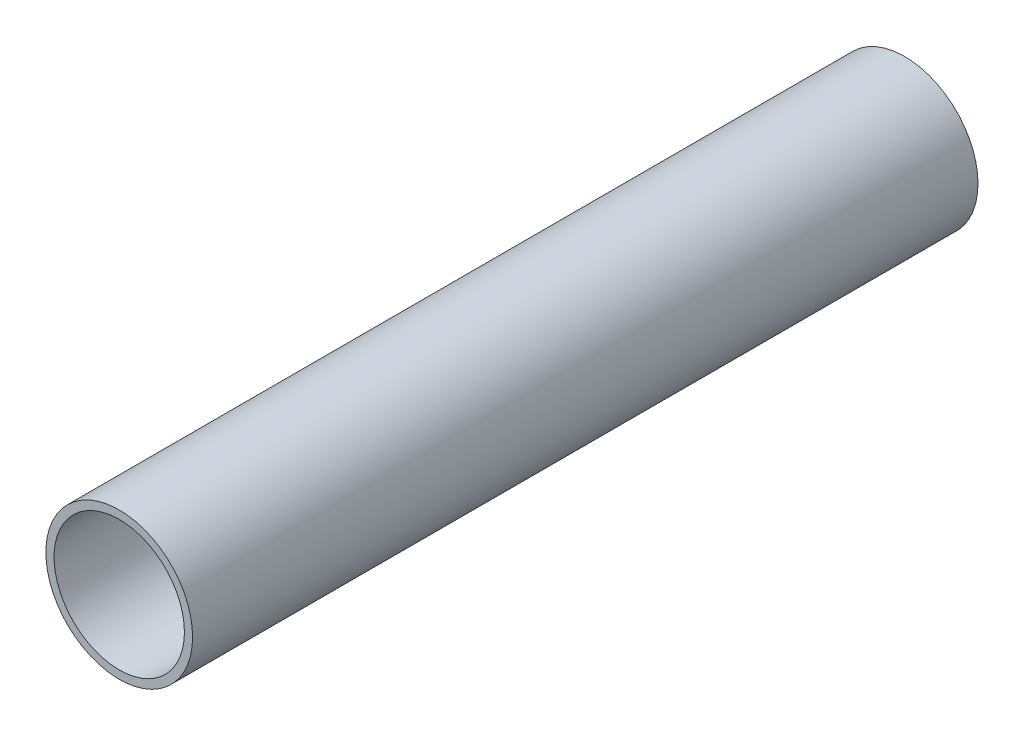
ISO-10303-21;
HEADER;
FILE_DESCRIPTION(('STEP AP214'),'2;1');
FILE_NAME('part.step','',(''),(''),'','','');
FILE_SCHEMA(('AUTOMOTIVE_DESIGN { 1 0 10303 214 1 1 1 1 }'));
ENDSEC;
DATA;
#1=APPLICATION_CONTEXT('core data for automotive mechanical design processes');
#2=APPLICATION_PROTOCOL_DEFINITION('international standard','automotive_design',2000,#1);
#3=PRODUCT_CONTEXT('',#1,'mechanical');
#4=PRODUCT('Part','Part','',(#3));
#5=PRODUCT_RELATED_PRODUCT_CATEGORY('part','',(#4));
#6=PRODUCT_DEFINITION_FORMATION('','',#4);
#7=PRODUCT_DEFINITION_CONTEXT('part definition',#1,'design');
#8=PRODUCT_DEFINITION('design','',#6,#7);
#9=PRODUCT_DEFINITION_SHAPE('','',#8);
#10=(LENGTH_UNIT() NAMED_UNIT(*) SI_UNIT(.MILLI.,.METRE.));
#11=(NAMED_UNIT(*) PLANE_ANGLE_UNIT() SI_UNIT($,.RADIAN.));
#12=(NAMED_UNIT(*) SI_UNIT($,.STERADIAN.) SOLID_ANGLE_UNIT());
#13=UNCERTAINTY_MEASURE_WITH_UNIT(LENGTH_MEASURE(1.E-05),#10,'distance_accuracy_value','');
#14=(GEOMETRIC_REPRESENTATION_CONTEXT(3) GLOBAL_UNCERTAINTY_ASSIGNED_CONTEXT((#13)) GLOBAL_UNIT_ASSIGNED_CONTEXT((#10,
#11,#12)) REPRESENTATION_CONTEXT('',''));
#15=CARTESIAN_POINT('',(0.,0.,0.));
#16=DIRECTION('',(0.,0.,1.));
#17=DIRECTION('',(1.,0.,0.));
#18=AXIS2_PLACEMENT_3D('',#15,#16,#17);
#19=CARTESIAN_POINT('',(0.,0.,609.6));
#20=DIRECTION('',(0.,0.,1.));
#21=DIRECTION('',(1.,0.,0.));
#22=AXIS2_PLACEMENT_3D('',#19,#20,#21);
#23=PLANE('',#22);
#24=CARTESIAN_POINT('',(0.,0.,609.6));
#25=DIRECTION('',(0.,0.,1.));
#26=DIRECTION('',(1.,0.,0.));
#27=AXIS2_PLACEMENT_3D('',#24,#25,#26);
#28=CIRCLE('',#27,56.945);
#29=CARTESIAN_POINT('',(56.945,0.,609.6));
#30=VERTEX_POINT('',#29);
#31=EDGE_CURVE('E10',#30,#30,#28,.T.);
#32=ORIENTED_EDGE('',*,*,#31,.T.);
#33=EDGE_LOOP('',(#32));
#34=FACE_BOUND('',#33,.T.);
#35=CARTESIAN_POINT('',(0.,0.,609.6));
#36=DIRECTION('',(0.,0.,1.));
#37=DIRECTION('',(1.,0.,0.));
#38=AXIS2_PLACEMENT_3D('',#35,#36,#37);
#39=CIRCLE('',#38,50.595);
#40=CARTESIAN_POINT('',(50.595,0.,609.6));
#41=VERTEX_POINT('',#40);
#42=EDGE_CURVE('E45',#41,#41,#39,.T.);
#43=ORIENTED_EDGE('',*,*,#42,.F.);
#44=EDGE_LOOP('',(#43));
#45=FACE_BOUND('',#44,.T.);
#46=ADVANCED_FACE('F34',(#34,#45),#23,.T.);
#47=CARTESIAN_POINT('',(0.,0.,0.));
#48=DIRECTION('',(0.,0.,1.));
#49=DIRECTION('',(1.,0.,0.));
#50=AXIS2_PLACEMENT_3D('',#47,#48,#49);
#51=PLANE('',#50);
#52=CARTESIAN_POINT('',(0.,0.,0.));
#53=DIRECTION('',(0.,0.,1.));
#54=DIRECTION('',(1.,0.,0.));
#55=AXIS2_PLACEMENT_3D('',#52,#53,#54);
#56=CIRCLE('',#55,56.945);
#57=CARTESIAN_POINT('',(56.945,0.,0.));
#58=VERTEX_POINT('',#57);
#59=EDGE_CURVE('E38',#58,#58,#56,.T.);
#60=ORIENTED_EDGE('',*,*,#59,.F.);
#61=EDGE_LOOP('',(#60));
#62=FACE_BOUND('',#61,.T.);
#63=CARTESIAN_POINT('',(0.,0.,0.));
#64=DIRECTION('',(0.,0.,1.));
#65=DIRECTION('',(1.,0.,0.));
#66=AXIS2_PLACEMENT_3D('',#63,#64,#65);
#67=CIRCLE('',#66,50.595);
#68=CARTESIAN_POINT('',(50.595,0.,0.));
#69=VERTEX_POINT('',#68);
#70=EDGE_CURVE('E47',#69,#69,#67,.T.);
#71=ORIENTED_EDGE('',*,*,#70,.T.);
#72=EDGE_LOOP('',(#71));
#73=FACE_BOUND('',#72,.T.);
#74=ADVANCED_FACE('F57',(#62,#73),#51,.F.);
#75=CARTESIAN_POINT('',(0.,0.,609.6));
#76=DIRECTION('',(0.,0.,-1.));
#77=DIRECTION('',(-1.,0.,0.));
#78=AXIS2_PLACEMENT_3D('',#75,#76,#77);
#79=CYLINDRICAL_SURFACE('',#78,56.945);
#80=ORIENTED_EDGE('',*,*,#31,.F.);
#81=EDGE_LOOP('',(#80));
#82=FACE_BOUND('',#81,.T.);
#83=ORIENTED_EDGE('',*,*,#59,.T.);
#84=EDGE_LOOP('',(#83));
#85=FACE_BOUND('',#84,.T.);
#86=ADVANCED_FACE('F36',(#82,#85),#79,.T.);
#87=CARTESIAN_POINT('',(0.,0.,609.6));
#88=DIRECTION('',(0.,0.,-1.));
#89=DIRECTION('',(-1.,0.,0.));
#90=AXIS2_PLACEMENT_3D('',#87,#88,#89);
#91=CYLINDRICAL_SURFACE('',#90,50.595);
#92=ORIENTED_EDGE('',*,*,#42,.T.);
#93=EDGE_LOOP('',(#92));
#94=FACE_BOUND('',#93,.T.);
#95=ORIENTED_EDGE('',*,*,#70,.F.);
#96=EDGE_LOOP('',(#95));
#97=FACE_BOUND('',#96,.T.);
#98=ADVANCED_FACE('F53',(#94,#97),#91,.F.);
#99=CLOSED_SHELL('',(#46,#74,#86,#98));
#100=MANIFOLD_SOLID_BREP('B2',#99);
#101=ADVANCED_BREP_SHAPE_REPRESENTATION('',(#18,#100),#14);
#102=SHAPE_DEFINITION_REPRESENTATION(#9,#101);
ENDSEC;
END-ISO-10303-21;
